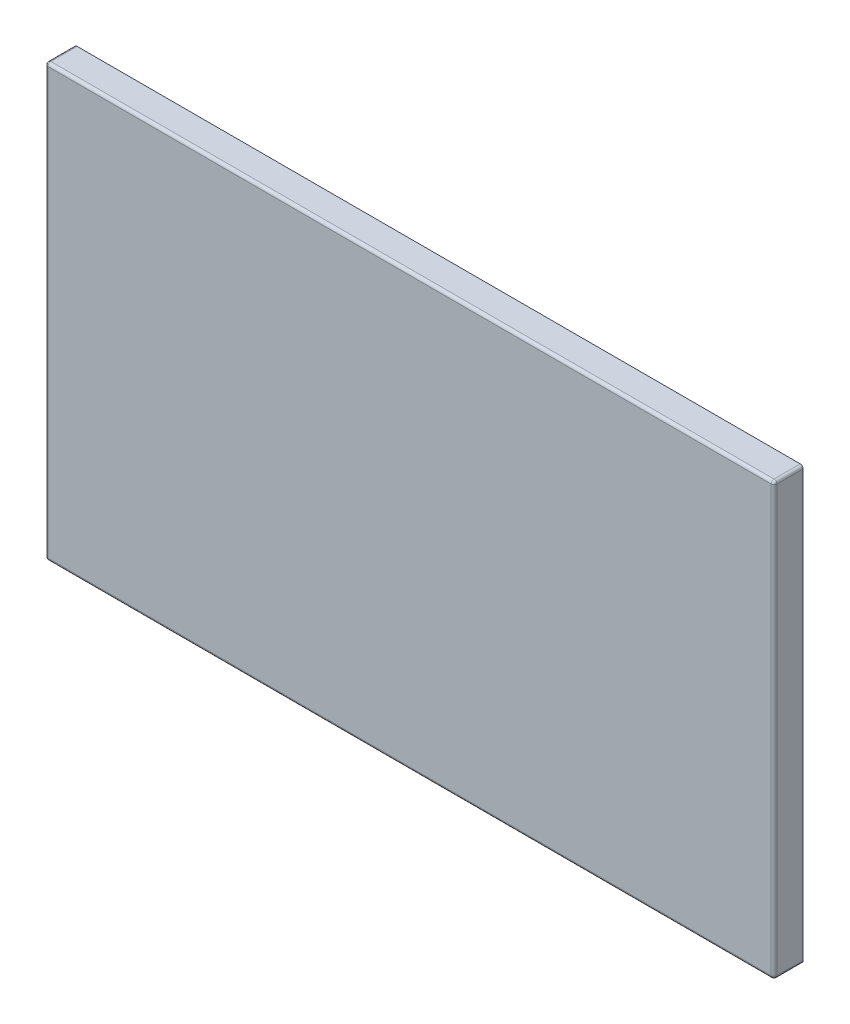
ISO-10303-21;
HEADER;
FILE_DESCRIPTION(('STEP AP214'),'2;1');
FILE_NAME('part.step','',(''),(''),'','','');
FILE_SCHEMA(('AUTOMOTIVE_DESIGN { 1 0 10303 214 1 1 1 1 }'));
ENDSEC;
DATA;
#1=APPLICATION_CONTEXT('core data for automotive mechanical design processes');
#2=APPLICATION_PROTOCOL_DEFINITION('international standard','automotive_design',2000,#1);
#3=PRODUCT_CONTEXT('',#1,'mechanical');
#4=PRODUCT('Part','Part','',(#3));
#5=PRODUCT_RELATED_PRODUCT_CATEGORY('part','',(#4));
#6=PRODUCT_DEFINITION_FORMATION('','',#4);
#7=PRODUCT_DEFINITION_CONTEXT('part definition',#1,'design');
#8=PRODUCT_DEFINITION('design','',#6,#7);
#9=PRODUCT_DEFINITION_SHAPE('','',#8);
#10=(LENGTH_UNIT() NAMED_UNIT(*) SI_UNIT(.MILLI.,.METRE.));
#11=(NAMED_UNIT(*) PLANE_ANGLE_UNIT() SI_UNIT($,.RADIAN.));
#12=(NAMED_UNIT(*) SI_UNIT($,.STERADIAN.) SOLID_ANGLE_UNIT());
#13=UNCERTAINTY_MEASURE_WITH_UNIT(LENGTH_MEASURE(1.E-05),#10,'distance_accuracy_value','');
#14=(GEOMETRIC_REPRESENTATION_CONTEXT(3) GLOBAL_UNCERTAINTY_ASSIGNED_CONTEXT((#13)) GLOBAL_UNIT_ASSIGNED_CONTEXT((#10,
#11,#12)) REPRESENTATION_CONTEXT('',''));
#15=CARTESIAN_POINT('',(0.,0.,0.));
#16=DIRECTION('',(0.,0.,1.));
#17=DIRECTION('',(1.,0.,0.));
#18=AXIS2_PLACEMENT_3D('',#15,#16,#17);
#19=CARTESIAN_POINT('',(0.,1480.,100.));
#20=DIRECTION('',(1.,0.,0.));
#21=DIRECTION('',(0.,1.,0.));
#22=AXIS2_PLACEMENT_3D('',#19,#20,#21);
#23=PLANE('',#22);
#24=DIRECTION('',(0.,-1.,0.));
#25=VECTOR('',#24,1.);
#26=CARTESIAN_POINT('',(0.,1480.,0.));
#27=LINE('',#26,#25);
#28=CARTESIAN_POINT('',(0.,1470.,0.));
#29=VERTEX_POINT('',#28);
#30=CARTESIAN_POINT('',(0.,10.,0.));
#31=VERTEX_POINT('',#30);
#32=EDGE_CURVE('E175',#29,#31,#27,.T.);
#33=ORIENTED_EDGE('',*,*,#32,.T.);
#34=DIRECTION('',(0.,0.,-1.));
#35=VECTOR('',#34,1.);
#36=CARTESIAN_POINT('',(0.,10.,100.));
#37=LINE('',#36,#35);
#38=CARTESIAN_POINT('',(0.,10.,90.));
#39=VERTEX_POINT('',#38);
#40=EDGE_CURVE('E63',#31,#39,#37,.F.);
#41=ORIENTED_EDGE('',*,*,#40,.T.);
#42=DIRECTION('',(0.,-1.,0.));
#43=VECTOR('',#42,1.);
#44=CARTESIAN_POINT('',(0.,1480.,90.));
#45=LINE('',#44,#43);
#46=CARTESIAN_POINT('',(0.,1470.,90.));
#47=VERTEX_POINT('',#46);
#48=EDGE_CURVE('E68',#39,#47,#45,.F.);
#49=ORIENTED_EDGE('',*,*,#48,.T.);
#50=DIRECTION('',(0.,0.,-1.));
#51=VECTOR('',#50,1.);
#52=CARTESIAN_POINT('',(0.,1470.,100.));
#53=LINE('',#52,#51);
#54=EDGE_CURVE('E258',#47,#29,#53,.T.);
#55=ORIENTED_EDGE('',*,*,#54,.T.);
#56=EDGE_LOOP('',(#33,#41,#49,#55));
#57=FACE_BOUND('',#56,.T.);
#58=ADVANCED_FACE('F45',(#57),#23,.F.);
#59=CARTESIAN_POINT('',(0.,0.,100.));
#60=DIRECTION('',(0.,1.,0.));
#61=DIRECTION('',(0.,0.,1.));
#62=AXIS2_PLACEMENT_3D('',#59,#60,#61);
#63=PLANE('',#62);
#64=DIRECTION('',(1.,0.,0.));
#65=VECTOR('',#64,1.);
#66=CARTESIAN_POINT('',(0.,0.,90.));
#67=LINE('',#66,#65);
#68=CARTESIAN_POINT('',(2490.,0.,90.));
#69=VERTEX_POINT('',#68);
#70=CARTESIAN_POINT('',(10.,0.,90.));
#71=VERTEX_POINT('',#70);
#72=EDGE_CURVE('E252',#69,#71,#67,.F.);
#73=ORIENTED_EDGE('',*,*,#72,.T.);
#74=DIRECTION('',(0.,0.,-1.));
#75=VECTOR('',#74,1.);
#76=CARTESIAN_POINT('',(10.,0.,100.));
#77=LINE('',#76,#75);
#78=CARTESIAN_POINT('',(10.,0.,0.));
#79=VERTEX_POINT('',#78);
#80=EDGE_CURVE('E255',#71,#79,#77,.T.);
#81=ORIENTED_EDGE('',*,*,#80,.T.);
#82=DIRECTION('',(1.,0.,0.));
#83=VECTOR('',#82,1.);
#84=CARTESIAN_POINT('',(0.,0.,0.));
#85=LINE('',#84,#83);
#86=CARTESIAN_POINT('',(2490.,0.,0.));
#87=VERTEX_POINT('',#86);
#88=EDGE_CURVE('E180',#79,#87,#85,.T.);
#89=ORIENTED_EDGE('',*,*,#88,.T.);
#90=DIRECTION('',(0.,0.,-1.));
#91=VECTOR('',#90,1.);
#92=CARTESIAN_POINT('',(2490.,0.,100.));
#93=LINE('',#92,#91);
#94=EDGE_CURVE('E249',#87,#69,#93,.F.);
#95=ORIENTED_EDGE('',*,*,#94,.T.);
#96=EDGE_LOOP('',(#73,#81,#89,#95));
#97=FACE_BOUND('',#96,.T.);
#98=ADVANCED_FACE('F341',(#97),#63,.F.);
#99=CARTESIAN_POINT('',(2500.,0.,100.));
#100=DIRECTION('',(-1.,0.,0.));
#101=DIRECTION('',(0.,0.,1.));
#102=AXIS2_PLACEMENT_3D('',#99,#100,#101);
#103=PLANE('',#102);
#104=DIRECTION('',(0.,1.,0.));
#105=VECTOR('',#104,1.);
#106=CARTESIAN_POINT('',(2500.,0.,0.));
#107=LINE('',#106,#105);
#108=CARTESIAN_POINT('',(2500.,10.,0.));
#109=VERTEX_POINT('',#108);
#110=CARTESIAN_POINT('',(2500.,1470.,0.));
#111=VERTEX_POINT('',#110);
#112=EDGE_CURVE('E209',#109,#111,#107,.T.);
#113=ORIENTED_EDGE('',*,*,#112,.T.);
#114=DIRECTION('',(0.,0.,-1.));
#115=VECTOR('',#114,1.);
#116=CARTESIAN_POINT('',(2500.,1470.,100.));
#117=LINE('',#116,#115);
#118=CARTESIAN_POINT('',(2500.,1470.,90.));
#119=VERTEX_POINT('',#118);
#120=EDGE_CURVE('E246',#111,#119,#117,.F.);
#121=ORIENTED_EDGE('',*,*,#120,.T.);
#122=DIRECTION('',(0.,1.,0.));
#123=VECTOR('',#122,1.);
#124=CARTESIAN_POINT('',(2500.,0.,90.));
#125=LINE('',#124,#123);
#126=CARTESIAN_POINT('',(2500.,10.,90.));
#127=VERTEX_POINT('',#126);
#128=EDGE_CURVE('E243',#119,#127,#125,.F.);
#129=ORIENTED_EDGE('',*,*,#128,.T.);
#130=DIRECTION('',(0.,0.,-1.));
#131=VECTOR('',#130,1.);
#132=CARTESIAN_POINT('',(2500.,10.,100.));
#133=LINE('',#132,#131);
#134=EDGE_CURVE('E240',#127,#109,#133,.T.);
#135=ORIENTED_EDGE('',*,*,#134,.T.);
#136=EDGE_LOOP('',(#113,#121,#129,#135));
#137=FACE_BOUND('',#136,.T.);
#138=ADVANCED_FACE('F374',(#137),#103,.F.);
#139=CARTESIAN_POINT('',(2500.,1480.,100.));
#140=DIRECTION('',(0.,-1.,0.));
#141=DIRECTION('',(1.,0.,0.));
#142=AXIS2_PLACEMENT_3D('',#139,#140,#141);
#143=PLANE('',#142);
#144=DIRECTION('',(-1.,0.,0.));
#145=VECTOR('',#144,1.);
#146=CARTESIAN_POINT('',(2500.,1480.,0.));
#147=LINE('',#146,#145);
#148=CARTESIAN_POINT('',(2490.,1480.,0.));
#149=VERTEX_POINT('',#148);
#150=CARTESIAN_POINT('',(9.99999999999979,1480.,0.));
#151=VERTEX_POINT('',#150);
#152=EDGE_CURVE('E213',#149,#151,#147,.T.);
#153=ORIENTED_EDGE('',*,*,#152,.T.);
#154=DIRECTION('',(0.,0.,-1.));
#155=VECTOR('',#154,1.);
#156=CARTESIAN_POINT('',(9.99999999999979,1480.,100.));
#157=LINE('',#156,#155);
#158=CARTESIAN_POINT('',(9.99999999999999,1480.,90.));
#159=VERTEX_POINT('',#158);
#160=EDGE_CURVE('E237',#151,#159,#157,.F.);
#161=ORIENTED_EDGE('',*,*,#160,.T.);
#162=DIRECTION('',(-1.,0.,0.));
#163=VECTOR('',#162,1.);
#164=CARTESIAN_POINT('',(2500.,1480.,90.));
#165=LINE('',#164,#163);
#166=CARTESIAN_POINT('',(2490.,1480.,90.));
#167=VERTEX_POINT('',#166);
#168=EDGE_CURVE('E233',#159,#167,#165,.F.);
#169=ORIENTED_EDGE('',*,*,#168,.T.);
#170=DIRECTION('',(0.,0.,-1.));
#171=VECTOR('',#170,1.);
#172=CARTESIAN_POINT('',(2490.,1480.,100.));
#173=LINE('',#172,#171);
#174=EDGE_CURVE('E230',#167,#149,#173,.T.);
#175=ORIENTED_EDGE('',*,*,#174,.T.);
#176=EDGE_LOOP('',(#153,#161,#169,#175));
#177=FACE_BOUND('',#176,.T.);
#178=ADVANCED_FACE('F365',(#177),#143,.F.);
#179=CARTESIAN_POINT('',(0.,0.,100.));
#180=DIRECTION('',(0.,0.,1.));
#181=DIRECTION('',(1.,0.,0.));
#182=AXIS2_PLACEMENT_3D('',#179,#180,#181);
#183=PLANE('',#182);
#184=DIRECTION('',(0.,1.,0.));
#185=VECTOR('',#184,1.);
#186=CARTESIAN_POINT('',(2490.,1480.,100.));
#187=LINE('',#186,#185);
#188=CARTESIAN_POINT('',(2490.,10.,100.));
#189=VERTEX_POINT('',#188);
#190=CARTESIAN_POINT('',(2490.,1470.,100.));
#191=VERTEX_POINT('',#190);
#192=EDGE_CURVE('E223',#189,#191,#187,.T.);
#193=ORIENTED_EDGE('',*,*,#192,.T.);
#194=DIRECTION('',(-1.,0.,0.));
#195=VECTOR('',#194,1.);
#196=CARTESIAN_POINT('',(0.,1470.,100.));
#197=LINE('',#196,#195);
#198=CARTESIAN_POINT('',(9.99999999999999,1470.,100.));
#199=VERTEX_POINT('',#198);
#200=EDGE_CURVE('E226',#191,#199,#197,.T.);
#201=ORIENTED_EDGE('',*,*,#200,.T.);
#202=DIRECTION('',(0.,-1.,0.));
#203=VECTOR('',#202,1.);
#204=CARTESIAN_POINT('',(10.,0.,100.));
#205=LINE('',#204,#203);
#206=CARTESIAN_POINT('',(10.,10.,100.));
#207=VERTEX_POINT('',#206);
#208=EDGE_CURVE('E217',#199,#207,#205,.T.);
#209=ORIENTED_EDGE('',*,*,#208,.T.);
#210=DIRECTION('',(1.,0.,0.));
#211=VECTOR('',#210,1.);
#212=CARTESIAN_POINT('',(2500.,10.,100.));
#213=LINE('',#212,#211);
#214=EDGE_CURVE('E220',#207,#189,#213,.T.);
#215=ORIENTED_EDGE('',*,*,#214,.T.);
#216=EDGE_LOOP('',(#193,#201,#209,#215));
#217=FACE_BOUND('',#216,.T.);
#218=ADVANCED_FACE('F331',(#217),#183,.T.);
#219=CARTESIAN_POINT('',(0.,0.,0.));
#220=DIRECTION('',(0.,0.,1.));
#221=DIRECTION('',(1.,0.,0.));
#222=AXIS2_PLACEMENT_3D('',#219,#220,#221);
#223=PLANE('',#222);
#224=DIRECTION('',(-1.,0.,0.));
#225=VECTOR('',#224,1.);
#226=CARTESIAN_POINT('',(2500.,1460.,0.));
#227=LINE('',#226,#225);
#228=CARTESIAN_POINT('',(2480.,1460.,0.));
#229=VERTEX_POINT('',#228);
#230=CARTESIAN_POINT('',(20.,1460.,0.));
#231=VERTEX_POINT('',#230);
#232=EDGE_CURVE('E169',#229,#231,#227,.T.);
#233=ORIENTED_EDGE('',*,*,#232,.T.);
#234=DIRECTION('',(0.,-1.,0.));
#235=VECTOR('',#234,1.);
#236=CARTESIAN_POINT('',(20.,1480.,0.));
#237=LINE('',#236,#235);
#238=CARTESIAN_POINT('',(20.,20.,0.));
#239=VERTEX_POINT('',#238);
#240=EDGE_CURVE('E194',#231,#239,#237,.T.);
#241=ORIENTED_EDGE('',*,*,#240,.T.);
#242=DIRECTION('',(1.,0.,0.));
#243=VECTOR('',#242,1.);
#244=CARTESIAN_POINT('',(0.,20.,0.));
#245=LINE('',#244,#243);
#246=CARTESIAN_POINT('',(2480.,20.,0.));
#247=VERTEX_POINT('',#246);
#248=EDGE_CURVE('E173',#239,#247,#245,.T.);
#249=ORIENTED_EDGE('',*,*,#248,.T.);
#250=DIRECTION('',(0.,1.,0.));
#251=VECTOR('',#250,1.);
#252=CARTESIAN_POINT('',(2480.,0.,0.));
#253=LINE('',#252,#251);
#254=EDGE_CURVE('E200',#247,#229,#253,.T.);
#255=ORIENTED_EDGE('',*,*,#254,.T.);
#256=EDGE_LOOP('',(#233,#241,#249,#255));
#257=FACE_BOUND('',#256,.T.);
#258=ORIENTED_EDGE('',*,*,#88,.F.);
#259=CARTESIAN_POINT('',(10.,10.,0.));
#260=DIRECTION('',(0.,0.,1.));
#261=DIRECTION('',(1.,0.,0.));
#262=AXIS2_PLACEMENT_3D('',#259,#260,#261);
#263=CIRCLE('',#262,10.);
#264=EDGE_CURVE('E11',#79,#31,#263,.F.);
#265=ORIENTED_EDGE('',*,*,#264,.T.);
#266=ORIENTED_EDGE('',*,*,#32,.F.);
#267=CARTESIAN_POINT('',(9.99999999999999,1470.,0.));
#268=DIRECTION('',(0.,0.,1.));
#269=DIRECTION('',(1.,0.,0.));
#270=AXIS2_PLACEMENT_3D('',#267,#268,#269);
#271=CIRCLE('',#270,10.);
#272=EDGE_CURVE('E55',#29,#151,#271,.F.);
#273=ORIENTED_EDGE('',*,*,#272,.T.);
#274=ORIENTED_EDGE('',*,*,#152,.F.);
#275=CARTESIAN_POINT('',(2490.,1470.,0.));
#276=DIRECTION('',(0.,0.,1.));
#277=DIRECTION('',(1.,0.,0.));
#278=AXIS2_PLACEMENT_3D('',#275,#276,#277);
#279=CIRCLE('',#278,10.);
#280=EDGE_CURVE('E268',#149,#111,#279,.F.);
#281=ORIENTED_EDGE('',*,*,#280,.T.);
#282=ORIENTED_EDGE('',*,*,#112,.F.);
#283=CARTESIAN_POINT('',(2490.,10.,0.));
#284=DIRECTION('',(0.,0.,1.));
#285=DIRECTION('',(1.,0.,0.));
#286=AXIS2_PLACEMENT_3D('',#283,#284,#285);
#287=CIRCLE('',#286,10.);
#288=EDGE_CURVE('E265',#109,#87,#287,.F.);
#289=ORIENTED_EDGE('',*,*,#288,.T.);
#290=EDGE_LOOP('',(#258,#265,#266,#273,#274,#281,#282,#289));
#291=FACE_BOUND('',#290,.T.);
#292=ADVANCED_FACE('F349',(#257,#291),#223,.F.);
#293=CARTESIAN_POINT('',(20.,1480.,100.));
#294=DIRECTION('',(1.,0.,0.));
#295=DIRECTION('',(0.,1.,0.));
#296=AXIS2_PLACEMENT_3D('',#293,#294,#295);
#297=PLANE('',#296);
#298=ORIENTED_EDGE('',*,*,#240,.F.);
#299=DIRECTION('',(0.,0.,-1.));
#300=VECTOR('',#299,1.);
#301=CARTESIAN_POINT('',(20.,1460.,100.));
#302=LINE('',#301,#300);
#303=CARTESIAN_POINT('',(20.,1460.,80.));
#304=VERTEX_POINT('',#303);
#305=EDGE_CURVE('E167',#304,#231,#302,.T.);
#306=ORIENTED_EDGE('',*,*,#305,.F.);
#307=DIRECTION('',(0.,-1.,0.));
#308=VECTOR('',#307,1.);
#309=CARTESIAN_POINT('',(20.,1480.,80.));
#310=LINE('',#309,#308);
#311=CARTESIAN_POINT('',(20.,20.,80.));
#312=VERTEX_POINT('',#311);
#313=EDGE_CURVE('E152',#304,#312,#310,.T.);
#314=ORIENTED_EDGE('',*,*,#313,.T.);
#315=DIRECTION('',(0.,0.,-1.));
#316=VECTOR('',#315,1.);
#317=CARTESIAN_POINT('',(20.,20.,100.));
#318=LINE('',#317,#316);
#319=EDGE_CURVE('E165',#312,#239,#318,.T.);
#320=ORIENTED_EDGE('',*,*,#319,.T.);
#321=EDGE_LOOP('',(#298,#306,#314,#320));
#322=FACE_BOUND('',#321,.T.);
#323=ADVANCED_FACE('F164',(#322),#297,.T.);
#324=CARTESIAN_POINT('',(0.,20.,100.));
#325=DIRECTION('',(0.,1.,0.));
#326=DIRECTION('',(0.,0.,1.));
#327=AXIS2_PLACEMENT_3D('',#324,#325,#326);
#328=PLANE('',#327);
#329=ORIENTED_EDGE('',*,*,#248,.F.);
#330=ORIENTED_EDGE('',*,*,#319,.F.);
#331=DIRECTION('',(1.,0.,0.));
#332=VECTOR('',#331,1.);
#333=CARTESIAN_POINT('',(0.,20.,80.));
#334=LINE('',#333,#332);
#335=CARTESIAN_POINT('',(2480.,20.,80.));
#336=VERTEX_POINT('',#335);
#337=EDGE_CURVE('E148',#312,#336,#334,.T.);
#338=ORIENTED_EDGE('',*,*,#337,.T.);
#339=DIRECTION('',(0.,0.,-1.));
#340=VECTOR('',#339,1.);
#341=CARTESIAN_POINT('',(2480.,20.,100.));
#342=LINE('',#341,#340);
#343=EDGE_CURVE('E176',#336,#247,#342,.T.);
#344=ORIENTED_EDGE('',*,*,#343,.T.);
#345=EDGE_LOOP('',(#329,#330,#338,#344));
#346=FACE_BOUND('',#345,.T.);
#347=ADVANCED_FACE('F171',(#346),#328,.T.);
#348=CARTESIAN_POINT('',(2480.,0.,100.));
#349=DIRECTION('',(-1.,0.,0.));
#350=DIRECTION('',(0.,0.,1.));
#351=AXIS2_PLACEMENT_3D('',#348,#349,#350);
#352=PLANE('',#351);
#353=ORIENTED_EDGE('',*,*,#254,.F.);
#354=ORIENTED_EDGE('',*,*,#343,.F.);
#355=DIRECTION('',(0.,1.,0.));
#356=VECTOR('',#355,1.);
#357=CARTESIAN_POINT('',(2480.,0.,80.));
#358=LINE('',#357,#356);
#359=CARTESIAN_POINT('',(2480.,1460.,80.));
#360=VERTEX_POINT('',#359);
#361=EDGE_CURVE('E153',#336,#360,#358,.T.);
#362=ORIENTED_EDGE('',*,*,#361,.T.);
#363=DIRECTION('',(0.,0.,-1.));
#364=VECTOR('',#363,1.);
#365=CARTESIAN_POINT('',(2480.,1460.,100.));
#366=LINE('',#365,#364);
#367=EDGE_CURVE('E182',#360,#229,#366,.T.);
#368=ORIENTED_EDGE('',*,*,#367,.T.);
#369=EDGE_LOOP('',(#353,#354,#362,#368));
#370=FACE_BOUND('',#369,.T.);
#371=ADVANCED_FACE('F495',(#370),#352,.T.);
#372=CARTESIAN_POINT('',(2500.,1460.,100.));
#373=DIRECTION('',(0.,-1.,0.));
#374=DIRECTION('',(1.,0.,0.));
#375=AXIS2_PLACEMENT_3D('',#372,#373,#374);
#376=PLANE('',#375);
#377=ORIENTED_EDGE('',*,*,#232,.F.);
#378=ORIENTED_EDGE('',*,*,#367,.F.);
#379=DIRECTION('',(-1.,0.,0.));
#380=VECTOR('',#379,1.);
#381=CARTESIAN_POINT('',(2500.,1460.,80.));
#382=LINE('',#381,#380);
#383=EDGE_CURVE('E186',#360,#304,#382,.T.);
#384=ORIENTED_EDGE('',*,*,#383,.T.);
#385=ORIENTED_EDGE('',*,*,#305,.T.);
#386=EDGE_LOOP('',(#377,#378,#384,#385));
#387=FACE_BOUND('',#386,.T.);
#388=ADVANCED_FACE('F382',(#387),#376,.T.);
#389=CARTESIAN_POINT('',(0.,0.,80.));
#390=DIRECTION('',(0.,0.,1.));
#391=DIRECTION('',(1.,0.,0.));
#392=AXIS2_PLACEMENT_3D('',#389,#390,#391);
#393=PLANE('',#392);
#394=ORIENTED_EDGE('',*,*,#313,.F.);
#395=ORIENTED_EDGE('',*,*,#383,.F.);
#396=ORIENTED_EDGE('',*,*,#361,.F.);
#397=ORIENTED_EDGE('',*,*,#337,.F.);
#398=EDGE_LOOP('',(#394,#395,#396,#397));
#399=FACE_BOUND('',#398,.T.);
#400=ADVANCED_FACE('F150',(#399),#393,.F.);
#401=CARTESIAN_POINT('',(2490.,10.,100.));
#402=DIRECTION('',(0.,0.,-1.));
#403=DIRECTION('',(-1.,0.,0.));
#404=AXIS2_PLACEMENT_3D('',#401,#402,#403);
#405=CYLINDRICAL_SURFACE('',#404,10.);
#406=ORIENTED_EDGE('',*,*,#288,.F.);
#407=ORIENTED_EDGE('',*,*,#134,.F.);
#408=CARTESIAN_POINT('',(2490.,10.,90.));
#409=DIRECTION('',(0.,0.,1.));
#410=DIRECTION('',(1.,0.,0.));
#411=AXIS2_PLACEMENT_3D('',#408,#409,#410);
#412=CIRCLE('',#411,10.);
#413=EDGE_CURVE('E49',#69,#127,#412,.T.);
#414=ORIENTED_EDGE('',*,*,#413,.F.);
#415=ORIENTED_EDGE('',*,*,#94,.F.);
#416=EDGE_LOOP('',(#406,#407,#414,#415));
#417=FACE_BOUND('',#416,.T.);
#418=ADVANCED_FACE('F47',(#417),#405,.T.);
#419=CARTESIAN_POINT('',(0.,10.,90.));
#420=DIRECTION('',(-1.,0.,0.));
#421=DIRECTION('',(0.,0.,1.));
#422=AXIS2_PLACEMENT_3D('',#419,#420,#421);
#423=CYLINDRICAL_SURFACE('',#422,10.);
#424=CARTESIAN_POINT('',(10.,10.,90.));
#425=DIRECTION('',(-1.,0.,0.));
#426=DIRECTION('',(0.,0.,1.));
#427=AXIS2_PLACEMENT_3D('',#424,#425,#426);
#428=CIRCLE('',#427,10.);
#429=EDGE_CURVE('E307',#71,#207,#428,.T.);
#430=ORIENTED_EDGE('',*,*,#429,.F.);
#431=ORIENTED_EDGE('',*,*,#72,.F.);
#432=CARTESIAN_POINT('',(2490.,10.,90.));
#433=DIRECTION('',(1.,0.,0.));
#434=DIRECTION('',(0.,0.,-1.));
#435=AXIS2_PLACEMENT_3D('',#432,#433,#434);
#436=CIRCLE('',#435,10.);
#437=EDGE_CURVE('E310',#189,#69,#436,.T.);
#438=ORIENTED_EDGE('',*,*,#437,.F.);
#439=ORIENTED_EDGE('',*,*,#214,.F.);
#440=EDGE_LOOP('',(#430,#431,#438,#439));
#441=FACE_BOUND('',#440,.T.);
#442=ADVANCED_FACE('F338',(#441),#423,.T.);
#443=CARTESIAN_POINT('',(10.,10.,100.));
#444=DIRECTION('',(0.,0.,-1.));
#445=DIRECTION('',(-1.,0.,0.));
#446=AXIS2_PLACEMENT_3D('',#443,#444,#445);
#447=CYLINDRICAL_SURFACE('',#446,10.);
#448=ORIENTED_EDGE('',*,*,#264,.F.);
#449=ORIENTED_EDGE('',*,*,#80,.F.);
#450=CARTESIAN_POINT('',(10.,10.,90.));
#451=DIRECTION('',(0.,0.,1.));
#452=DIRECTION('',(1.,0.,0.));
#453=AXIS2_PLACEMENT_3D('',#450,#451,#452);
#454=CIRCLE('',#453,10.);
#455=EDGE_CURVE('E303',#39,#71,#454,.T.);
#456=ORIENTED_EDGE('',*,*,#455,.F.);
#457=ORIENTED_EDGE('',*,*,#40,.F.);
#458=EDGE_LOOP('',(#448,#449,#456,#457));
#459=FACE_BOUND('',#458,.T.);
#460=ADVANCED_FACE('F345',(#459),#447,.T.);
#461=CARTESIAN_POINT('',(2490.,10.,90.));
#462=DIRECTION('',(0.,-1.,0.));
#463=DIRECTION('',(0.,0.,-1.));
#464=AXIS2_PLACEMENT_3D('',#461,#462,#463);
#465=SPHERICAL_SURFACE('',#464,10.);
#466=ORIENTED_EDGE('',*,*,#437,.T.);
#467=ORIENTED_EDGE('',*,*,#413,.T.);
#468=CARTESIAN_POINT('',(2490.,10.,90.));
#469=DIRECTION('',(0.,-1.,0.));
#470=DIRECTION('',(0.,0.,-1.));
#471=AXIS2_PLACEMENT_3D('',#468,#469,#470);
#472=CIRCLE('',#471,10.);
#473=EDGE_CURVE('E299',#189,#127,#472,.F.);
#474=ORIENTED_EDGE('',*,*,#473,.F.);
#475=EDGE_LOOP('',(#466,#467,#474));
#476=FACE_BOUND('',#475,.T.);
#477=ADVANCED_FACE('F319',(#476),#465,.T.);
#478=CARTESIAN_POINT('',(10.,10.,90.));
#479=DIRECTION('',(0.,-1.,0.));
#480=DIRECTION('',(0.,0.,-1.));
#481=AXIS2_PLACEMENT_3D('',#478,#479,#480);
#482=SPHERICAL_SURFACE('',#481,10.);
#483=ORIENTED_EDGE('',*,*,#455,.T.);
#484=ORIENTED_EDGE('',*,*,#429,.T.);
#485=CARTESIAN_POINT('',(10.,10.,90.));
#486=DIRECTION('',(0.,-1.,0.));
#487=DIRECTION('',(0.,0.,-1.));
#488=AXIS2_PLACEMENT_3D('',#485,#486,#487);
#489=CIRCLE('',#488,10.);
#490=EDGE_CURVE('E295',#39,#207,#489,.F.);
#491=ORIENTED_EDGE('',*,*,#490,.F.);
#492=EDGE_LOOP('',(#483,#484,#491));
#493=FACE_BOUND('',#492,.T.);
#494=ADVANCED_FACE('F408',(#493),#482,.T.);
#495=CARTESIAN_POINT('',(2490.,1470.,100.));
#496=DIRECTION('',(0.,0.,-1.));
#497=DIRECTION('',(-1.,0.,0.));
#498=AXIS2_PLACEMENT_3D('',#495,#496,#497);
#499=CYLINDRICAL_SURFACE('',#498,10.);
#500=ORIENTED_EDGE('',*,*,#280,.F.);
#501=ORIENTED_EDGE('',*,*,#174,.F.);
#502=CARTESIAN_POINT('',(2490.,1470.,90.));
#503=DIRECTION('',(0.,0.,1.));
#504=DIRECTION('',(1.,0.,0.));
#505=AXIS2_PLACEMENT_3D('',#502,#503,#504);
#506=CIRCLE('',#505,10.);
#507=EDGE_CURVE('E291',#119,#167,#506,.T.);
#508=ORIENTED_EDGE('',*,*,#507,.F.);
#509=ORIENTED_EDGE('',*,*,#120,.F.);
#510=EDGE_LOOP('',(#500,#501,#508,#509));
#511=FACE_BOUND('',#510,.T.);
#512=ADVANCED_FACE('F372',(#511),#499,.T.);
#513=CARTESIAN_POINT('',(2490.,0.,90.));
#514=DIRECTION('',(0.,-1.,0.));
#515=DIRECTION('',(0.,0.,-1.));
#516=AXIS2_PLACEMENT_3D('',#513,#514,#515);
#517=CYLINDRICAL_SURFACE('',#516,10.);
#518=ORIENTED_EDGE('',*,*,#473,.T.);
#519=ORIENTED_EDGE('',*,*,#128,.F.);
#520=CARTESIAN_POINT('',(2490.,1470.,90.));
#521=DIRECTION('',(0.,1.,0.));
#522=DIRECTION('',(0.,0.,1.));
#523=AXIS2_PLACEMENT_3D('',#520,#521,#522);
#524=CIRCLE('',#523,10.);
#525=EDGE_CURVE('E287',#191,#119,#524,.T.);
#526=ORIENTED_EDGE('',*,*,#525,.F.);
#527=ORIENTED_EDGE('',*,*,#192,.F.);
#528=EDGE_LOOP('',(#518,#519,#526,#527));
#529=FACE_BOUND('',#528,.T.);
#530=ADVANCED_FACE('F326',(#529),#517,.T.);
#531=CARTESIAN_POINT('',(10.,0.,90.));
#532=DIRECTION('',(0.,1.,0.));
#533=DIRECTION('',(-1.,0.,0.));
#534=AXIS2_PLACEMENT_3D('',#531,#532,#533);
#535=CYLINDRICAL_SURFACE('',#534,10.);
#536=ORIENTED_EDGE('',*,*,#490,.T.);
#537=ORIENTED_EDGE('',*,*,#208,.F.);
#538=CARTESIAN_POINT('',(9.99999999999999,1470.,90.));
#539=DIRECTION('',(0.,1.,0.));
#540=DIRECTION('',(0.,0.,1.));
#541=AXIS2_PLACEMENT_3D('',#538,#539,#540);
#542=CIRCLE('',#541,10.);
#543=EDGE_CURVE('E283',#47,#199,#542,.T.);
#544=ORIENTED_EDGE('',*,*,#543,.F.);
#545=ORIENTED_EDGE('',*,*,#48,.F.);
#546=EDGE_LOOP('',(#536,#537,#544,#545));
#547=FACE_BOUND('',#546,.T.);
#548=ADVANCED_FACE('F358',(#547),#535,.T.);
#549=CARTESIAN_POINT('',(9.99999999999999,1470.,100.));
#550=DIRECTION('',(0.,0.,-1.));
#551=DIRECTION('',(-1.,0.,0.));
#552=AXIS2_PLACEMENT_3D('',#549,#550,#551);
#553=CYLINDRICAL_SURFACE('',#552,10.);
#554=ORIENTED_EDGE('',*,*,#272,.F.);
#555=ORIENTED_EDGE('',*,*,#54,.F.);
#556=CARTESIAN_POINT('',(9.99999999999999,1470.,90.));
#557=DIRECTION('',(0.,0.,1.));
#558=DIRECTION('',(1.,0.,0.));
#559=AXIS2_PLACEMENT_3D('',#556,#557,#558);
#560=CIRCLE('',#559,10.);
#561=EDGE_CURVE('E279',#159,#47,#560,.T.);
#562=ORIENTED_EDGE('',*,*,#561,.F.);
#563=ORIENTED_EDGE('',*,*,#160,.F.);
#564=EDGE_LOOP('',(#554,#555,#562,#563));
#565=FACE_BOUND('',#564,.T.);
#566=ADVANCED_FACE('F354',(#565),#553,.T.);
#567=CARTESIAN_POINT('',(2490.,1470.,90.));
#568=DIRECTION('',(1.,0.,0.));
#569=DIRECTION('',(0.,0.,-1.));
#570=AXIS2_PLACEMENT_3D('',#567,#568,#569);
#571=SPHERICAL_SURFACE('',#570,10.);
#572=ORIENTED_EDGE('',*,*,#525,.T.);
#573=ORIENTED_EDGE('',*,*,#507,.T.);
#574=CARTESIAN_POINT('',(2490.,1470.,90.));
#575=DIRECTION('',(1.,0.,0.));
#576=DIRECTION('',(0.,0.,-1.));
#577=AXIS2_PLACEMENT_3D('',#574,#575,#576);
#578=CIRCLE('',#577,10.);
#579=EDGE_CURVE('E276',#191,#167,#578,.F.);
#580=ORIENTED_EDGE('',*,*,#579,.F.);
#581=EDGE_LOOP('',(#572,#573,#580));
#582=FACE_BOUND('',#581,.T.);
#583=ADVANCED_FACE('F396',(#582),#571,.T.);
#584=CARTESIAN_POINT('',(9.99999999999999,1470.,90.));
#585=DIRECTION('',(-1.,0.,0.));
#586=DIRECTION('',(0.,0.,1.));
#587=AXIS2_PLACEMENT_3D('',#584,#585,#586);
#588=SPHERICAL_SURFACE('',#587,10.);
#589=ORIENTED_EDGE('',*,*,#561,.T.);
#590=ORIENTED_EDGE('',*,*,#543,.T.);
#591=CARTESIAN_POINT('',(9.99999999999999,1470.,90.));
#592=DIRECTION('',(-1.,0.,0.));
#593=DIRECTION('',(0.,-1.,0.));
#594=AXIS2_PLACEMENT_3D('',#591,#592,#593);
#595=CIRCLE('',#594,10.);
#596=EDGE_CURVE('E273',#159,#199,#595,.F.);
#597=ORIENTED_EDGE('',*,*,#596,.F.);
#598=EDGE_LOOP('',(#589,#590,#597));
#599=FACE_BOUND('',#598,.T.);
#600=ADVANCED_FACE('F361',(#599),#588,.T.);
#601=CARTESIAN_POINT('',(-1.30562227695918E-13,1470.,90.));
#602=DIRECTION('',(1.,0.,0.));
#603=DIRECTION('',(0.,1.,0.));
#604=AXIS2_PLACEMENT_3D('',#601,#602,#603);
#605=CYLINDRICAL_SURFACE('',#604,10.);
#606=ORIENTED_EDGE('',*,*,#579,.T.);
#607=ORIENTED_EDGE('',*,*,#168,.F.);
#608=ORIENTED_EDGE('',*,*,#596,.T.);
#609=ORIENTED_EDGE('',*,*,#200,.F.);
#610=EDGE_LOOP('',(#606,#607,#608,#609));
#611=FACE_BOUND('',#610,.T.);
#612=ADVANCED_FACE('F363',(#611),#605,.T.);
#613=CLOSED_SHELL('',(#58,#98,#138,#178,#218,#292,#323,#347,#371,#388,#400,#418,#442,#460,#477,
#494,#512,#530,#548,#566,#583,#600,#612));
#614=MANIFOLD_SOLID_BREP('B2',#613);
#615=ADVANCED_BREP_SHAPE_REPRESENTATION('',(#18,#614),#14);
#616=SHAPE_DEFINITION_REPRESENTATION(#9,#615);
ENDSEC;
END-ISO-10303-21;
